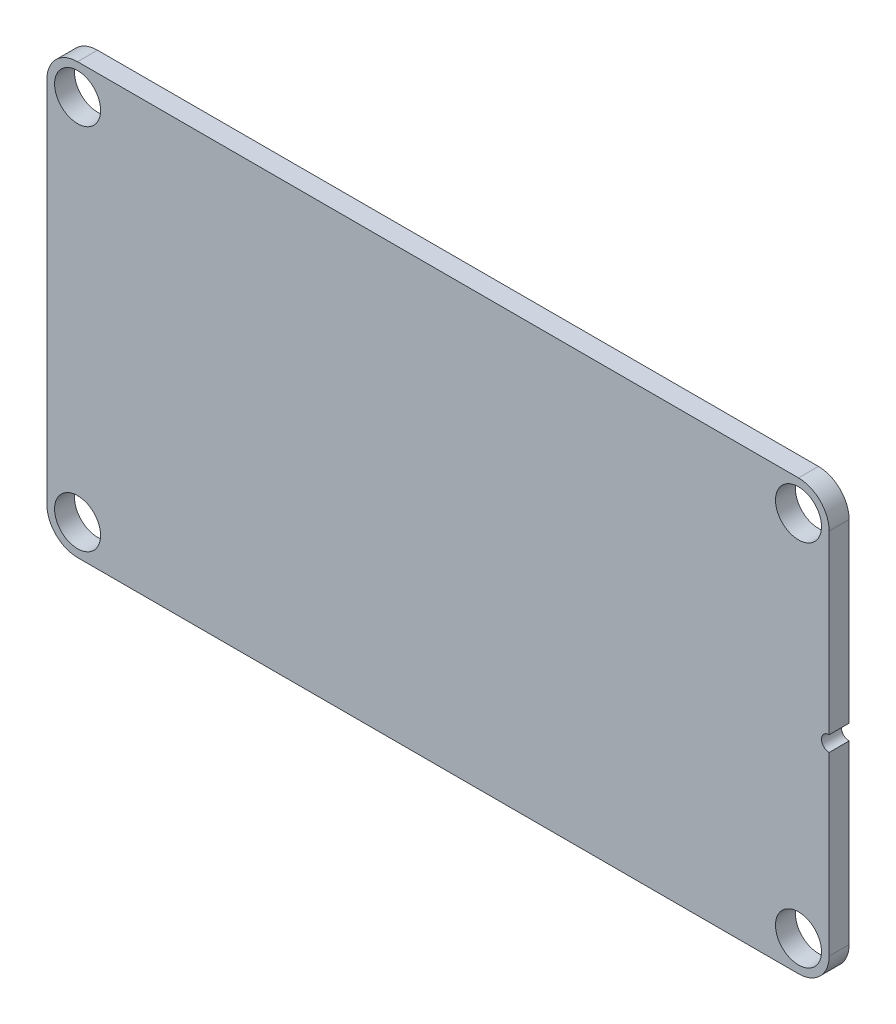
ISO-10303-21;
HEADER;
FILE_DESCRIPTION(('STEP AP214'),'2;1');
FILE_NAME('part.step','',(''),(''),'','','');
FILE_SCHEMA(('AUTOMOTIVE_DESIGN { 1 0 10303 214 1 1 1 1 }'));
ENDSEC;
DATA;
#1=APPLICATION_CONTEXT('core data for automotive mechanical design processes');
#2=APPLICATION_PROTOCOL_DEFINITION('international standard','automotive_design',2000,#1);
#3=PRODUCT_CONTEXT('',#1,'mechanical');
#4=PRODUCT('Part','Part','',(#3));
#5=PRODUCT_RELATED_PRODUCT_CATEGORY('part','',(#4));
#6=PRODUCT_DEFINITION_FORMATION('','',#4);
#7=PRODUCT_DEFINITION_CONTEXT('part definition',#1,'design');
#8=PRODUCT_DEFINITION('design','',#6,#7);
#9=PRODUCT_DEFINITION_SHAPE('','',#8);
#10=(LENGTH_UNIT() NAMED_UNIT(*) SI_UNIT(.MILLI.,.METRE.));
#11=(NAMED_UNIT(*) PLANE_ANGLE_UNIT() SI_UNIT($,.RADIAN.));
#12=(NAMED_UNIT(*) SI_UNIT($,.STERADIAN.) SOLID_ANGLE_UNIT());
#13=UNCERTAINTY_MEASURE_WITH_UNIT(LENGTH_MEASURE(1.E-05),#10,'distance_accuracy_value','');
#14=(GEOMETRIC_REPRESENTATION_CONTEXT(3) GLOBAL_UNCERTAINTY_ASSIGNED_CONTEXT((#13)) GLOBAL_UNIT_ASSIGNED_CONTEXT((#10,
#11,#12)) REPRESENTATION_CONTEXT('',''));
#15=CARTESIAN_POINT('',(0.,0.,0.));
#16=DIRECTION('',(0.,0.,1.));
#17=DIRECTION('',(1.,0.,0.));
#18=AXIS2_PLACEMENT_3D('',#15,#16,#17);
#19=CARTESIAN_POINT('',(25.5,14.,1.3));
#20=DIRECTION('',(-1.,0.,0.));
#21=DIRECTION('',(0.,0.,1.));
#22=AXIS2_PLACEMENT_3D('',#19,#20,#21);
#23=PLANE('',#22);
#24=DIRECTION('',(0.,1.,0.));
#25=VECTOR('',#24,1.);
#26=CARTESIAN_POINT('',(25.5,14.,0.));
#27=LINE('',#26,#25);
#28=CARTESIAN_POINT('',(25.5,-12.,0.));
#29=VERTEX_POINT('',#28);
#30=CARTESIAN_POINT('',(25.5,-0.499999999999997,0.));
#31=VERTEX_POINT('',#30);
#32=EDGE_CURVE('E154',#29,#31,#27,.T.);
#33=ORIENTED_EDGE('',*,*,#32,.T.);
#34=DIRECTION('',(0.,0.,1.));
#35=VECTOR('',#34,1.);
#36=CARTESIAN_POINT('',(25.5,-0.499999999999997,-7.5));
#37=LINE('',#36,#35);
#38=CARTESIAN_POINT('',(25.5,-0.499999999999997,1.3));
#39=VERTEX_POINT('',#38);
#40=EDGE_CURVE('E57',#31,#39,#37,.T.);
#41=ORIENTED_EDGE('',*,*,#40,.T.);
#42=DIRECTION('',(0.,1.,0.));
#43=VECTOR('',#42,1.);
#44=CARTESIAN_POINT('',(25.5,14.,1.3));
#45=LINE('',#44,#43);
#46=CARTESIAN_POINT('',(25.5,-12.,1.3));
#47=VERTEX_POINT('',#46);
#48=EDGE_CURVE('E133',#47,#39,#45,.T.);
#49=ORIENTED_EDGE('',*,*,#48,.F.);
#50=DIRECTION('',(0.,0.,-1.));
#51=VECTOR('',#50,1.);
#52=CARTESIAN_POINT('',(25.5,-12.,1.3));
#53=LINE('',#52,#51);
#54=EDGE_CURVE('E167',#47,#29,#53,.T.);
#55=ORIENTED_EDGE('',*,*,#54,.T.);
#56=EDGE_LOOP('',(#33,#41,#49,#55));
#57=FACE_BOUND('',#56,.T.);
#58=ADVANCED_FACE('F42',(#57),#23,.F.);
#59=CARTESIAN_POINT('',(-25.5,14.,1.3));
#60=DIRECTION('',(1.,0.,0.));
#61=DIRECTION('',(0.,1.,0.));
#62=AXIS2_PLACEMENT_3D('',#59,#60,#61);
#63=PLANE('',#62);
#64=DIRECTION('',(0.,-1.,0.));
#65=VECTOR('',#64,1.);
#66=CARTESIAN_POINT('',(-25.5,14.,1.3));
#67=LINE('',#66,#65);
#68=CARTESIAN_POINT('',(-25.5,12.,1.3));
#69=VERTEX_POINT('',#68);
#70=CARTESIAN_POINT('',(-25.5,-12.,1.3));
#71=VERTEX_POINT('',#70);
#72=EDGE_CURVE('E142',#69,#71,#67,.T.);
#73=ORIENTED_EDGE('',*,*,#72,.F.);
#74=DIRECTION('',(0.,0.,-1.));
#75=VECTOR('',#74,1.);
#76=CARTESIAN_POINT('',(-25.5,12.,1.3));
#77=LINE('',#76,#75);
#78=CARTESIAN_POINT('',(-25.5,12.,0.));
#79=VERTEX_POINT('',#78);
#80=EDGE_CURVE('E189',#69,#79,#77,.T.);
#81=ORIENTED_EDGE('',*,*,#80,.T.);
#82=DIRECTION('',(0.,-1.,0.));
#83=VECTOR('',#82,1.);
#84=CARTESIAN_POINT('',(-25.5,14.,0.));
#85=LINE('',#84,#83);
#86=CARTESIAN_POINT('',(-25.5,-12.,0.));
#87=VERTEX_POINT('',#86);
#88=EDGE_CURVE('E148',#79,#87,#85,.T.);
#89=ORIENTED_EDGE('',*,*,#88,.T.);
#90=DIRECTION('',(0.,0.,-1.));
#91=VECTOR('',#90,1.);
#92=CARTESIAN_POINT('',(-25.5,-12.,1.3));
#93=LINE('',#92,#91);
#94=EDGE_CURVE('E184',#87,#71,#93,.F.);
#95=ORIENTED_EDGE('',*,*,#94,.T.);
#96=EDGE_LOOP('',(#73,#81,#89,#95));
#97=FACE_BOUND('',#96,.T.);
#98=ADVANCED_FACE('F199',(#97),#63,.F.);
#99=CARTESIAN_POINT('',(-25.5,-14.,1.3));
#100=DIRECTION('',(0.,1.,0.));
#101=DIRECTION('',(-1.,0.,0.));
#102=AXIS2_PLACEMENT_3D('',#99,#100,#101);
#103=PLANE('',#102);
#104=DIRECTION('',(1.,0.,0.));
#105=VECTOR('',#104,1.);
#106=CARTESIAN_POINT('',(-25.5,-14.,1.3));
#107=LINE('',#106,#105);
#108=CARTESIAN_POINT('',(-23.5,-14.,1.3));
#109=VERTEX_POINT('',#108);
#110=CARTESIAN_POINT('',(23.5,-14.,1.3));
#111=VERTEX_POINT('',#110);
#112=EDGE_CURVE('E139',#109,#111,#107,.T.);
#113=ORIENTED_EDGE('',*,*,#112,.F.);
#114=DIRECTION('',(0.,0.,-1.));
#115=VECTOR('',#114,1.);
#116=CARTESIAN_POINT('',(-23.5,-14.,1.3));
#117=LINE('',#116,#115);
#118=CARTESIAN_POINT('',(-23.5,-14.,0.));
#119=VERTEX_POINT('',#118);
#120=EDGE_CURVE('E178',#109,#119,#117,.T.);
#121=ORIENTED_EDGE('',*,*,#120,.T.);
#122=DIRECTION('',(1.,0.,0.));
#123=VECTOR('',#122,1.);
#124=CARTESIAN_POINT('',(-25.5,-14.,0.));
#125=LINE('',#124,#123);
#126=CARTESIAN_POINT('',(23.5,-14.,0.));
#127=VERTEX_POINT('',#126);
#128=EDGE_CURVE('E150',#119,#127,#125,.T.);
#129=ORIENTED_EDGE('',*,*,#128,.T.);
#130=DIRECTION('',(0.,0.,-1.));
#131=VECTOR('',#130,1.);
#132=CARTESIAN_POINT('',(23.5,-14.,1.3));
#133=LINE('',#132,#131);
#134=EDGE_CURVE('E173',#127,#111,#133,.F.);
#135=ORIENTED_EDGE('',*,*,#134,.T.);
#136=EDGE_LOOP('',(#113,#121,#129,#135));
#137=FACE_BOUND('',#136,.T.);
#138=ADVANCED_FACE('F220',(#137),#103,.F.);
#139=CARTESIAN_POINT('',(25.5,0.500000000000001,1.3));
#140=VERTEX_POINT('',#139);
#141=CARTESIAN_POINT('',(25.5,12.,1.3));
#142=VERTEX_POINT('',#141);
#143=EDGE_CURVE('E130',#140,#142,#45,.T.);
#144=ORIENTED_EDGE('',*,*,#143,.F.);
#145=DIRECTION('',(0.,0.,1.));
#146=VECTOR('',#145,1.);
#147=CARTESIAN_POINT('',(25.5,0.500000000000001,-7.5));
#148=LINE('',#147,#146);
#149=CARTESIAN_POINT('',(25.5,0.500000000000001,0.));
#150=VERTEX_POINT('',#149);
#151=EDGE_CURVE('E118',#140,#150,#148,.F.);
#152=ORIENTED_EDGE('',*,*,#151,.T.);
#153=CARTESIAN_POINT('',(25.5,12.,0.));
#154=VERTEX_POINT('',#153);
#155=EDGE_CURVE('E153',#150,#154,#27,.T.);
#156=ORIENTED_EDGE('',*,*,#155,.T.);
#157=DIRECTION('',(0.,0.,-1.));
#158=VECTOR('',#157,1.);
#159=CARTESIAN_POINT('',(25.5,12.,1.3));
#160=LINE('',#159,#158);
#161=EDGE_CURVE('E137',#154,#142,#160,.F.);
#162=ORIENTED_EDGE('',*,*,#161,.T.);
#163=EDGE_LOOP('',(#144,#152,#156,#162));
#164=FACE_BOUND('',#163,.T.);
#165=ADVANCED_FACE('F135',(#164),#23,.F.);
#166=CARTESIAN_POINT('',(-25.5,14.,1.3));
#167=DIRECTION('',(0.,-1.,0.));
#168=DIRECTION('',(0.,0.,-1.));
#169=AXIS2_PLACEMENT_3D('',#166,#167,#168);
#170=PLANE('',#169);
#171=DIRECTION('',(-1.,0.,0.));
#172=VECTOR('',#171,1.);
#173=CARTESIAN_POINT('',(-25.5,14.,0.));
#174=LINE('',#173,#172);
#175=CARTESIAN_POINT('',(23.5,14.,0.));
#176=VERTEX_POINT('',#175);
#177=CARTESIAN_POINT('',(-23.5,14.,0.));
#178=VERTEX_POINT('',#177);
#179=EDGE_CURVE('E157',#176,#178,#174,.T.);
#180=ORIENTED_EDGE('',*,*,#179,.T.);
#181=DIRECTION('',(0.,0.,-1.));
#182=VECTOR('',#181,1.);
#183=CARTESIAN_POINT('',(-23.5,14.,1.3));
#184=LINE('',#183,#182);
#185=CARTESIAN_POINT('',(-23.5,14.,1.3));
#186=VERTEX_POINT('',#185);
#187=EDGE_CURVE('E64',#178,#186,#184,.F.);
#188=ORIENTED_EDGE('',*,*,#187,.T.);
#189=DIRECTION('',(-1.,0.,0.));
#190=VECTOR('',#189,1.);
#191=CARTESIAN_POINT('',(-25.5,14.,1.3));
#192=LINE('',#191,#190);
#193=CARTESIAN_POINT('',(23.5,14.,1.3));
#194=VERTEX_POINT('',#193);
#195=EDGE_CURVE('E141',#194,#186,#192,.T.);
#196=ORIENTED_EDGE('',*,*,#195,.F.);
#197=DIRECTION('',(0.,0.,-1.));
#198=VECTOR('',#197,1.);
#199=CARTESIAN_POINT('',(23.5,14.,1.3));
#200=LINE('',#199,#198);
#201=EDGE_CURVE('E147',#194,#176,#200,.T.);
#202=ORIENTED_EDGE('',*,*,#201,.T.);
#203=EDGE_LOOP('',(#180,#188,#196,#202));
#204=FACE_BOUND('',#203,.T.);
#205=ADVANCED_FACE('F206',(#204),#170,.F.);
#206=CARTESIAN_POINT('',(0.,0.,1.3));
#207=DIRECTION('',(0.,0.,1.));
#208=DIRECTION('',(1.,0.,0.));
#209=AXIS2_PLACEMENT_3D('',#206,#207,#208);
#210=PLANE('',#209);
#211=CARTESIAN_POINT('',(25.5,0.,1.3));
#212=DIRECTION('',(0.,0.,1.));
#213=DIRECTION('',(1.,0.,0.));
#214=AXIS2_PLACEMENT_3D('',#211,#212,#213);
#215=CIRCLE('',#214,0.499999999999999);
#216=EDGE_CURVE('E121',#140,#39,#215,.T.);
#217=ORIENTED_EDGE('',*,*,#216,.F.);
#218=ORIENTED_EDGE('',*,*,#143,.T.);
#219=CARTESIAN_POINT('',(23.5,12.,1.3));
#220=DIRECTION('',(0.,0.,1.));
#221=DIRECTION('',(1.,0.,0.));
#222=AXIS2_PLACEMENT_3D('',#219,#220,#221);
#223=CIRCLE('',#222,2.);
#224=EDGE_CURVE('E165',#142,#194,#223,.T.);
#225=ORIENTED_EDGE('',*,*,#224,.T.);
#226=ORIENTED_EDGE('',*,*,#195,.T.);
#227=CARTESIAN_POINT('',(-23.5,12.,1.3));
#228=DIRECTION('',(0.,0.,1.));
#229=DIRECTION('',(1.,0.,0.));
#230=AXIS2_PLACEMENT_3D('',#227,#228,#229);
#231=CIRCLE('',#230,2.);
#232=EDGE_CURVE('E50',#186,#69,#231,.T.);
#233=ORIENTED_EDGE('',*,*,#232,.T.);
#234=ORIENTED_EDGE('',*,*,#72,.T.);
#235=CARTESIAN_POINT('',(-23.5,-12.,1.3));
#236=DIRECTION('',(0.,0.,1.));
#237=DIRECTION('',(1.,0.,0.));
#238=AXIS2_PLACEMENT_3D('',#235,#236,#237);
#239=CIRCLE('',#238,2.);
#240=EDGE_CURVE('E187',#71,#109,#239,.T.);
#241=ORIENTED_EDGE('',*,*,#240,.T.);
#242=ORIENTED_EDGE('',*,*,#112,.T.);
#243=CARTESIAN_POINT('',(23.5,-12.,1.3));
#244=DIRECTION('',(0.,0.,1.));
#245=DIRECTION('',(1.,0.,0.));
#246=AXIS2_PLACEMENT_3D('',#243,#244,#245);
#247=CIRCLE('',#246,2.);
#248=EDGE_CURVE('E176',#111,#47,#247,.T.);
#249=ORIENTED_EDGE('',*,*,#248,.T.);
#250=ORIENTED_EDGE('',*,*,#48,.T.);
#251=EDGE_LOOP('',(#217,#218,#225,#226,#233,#234,#241,#242,#249,#250));
#252=FACE_BOUND('',#251,.T.);
#253=CARTESIAN_POINT('',(-23.5,12.,1.3));
#254=DIRECTION('',(0.,0.,1.));
#255=DIRECTION('',(1.,0.,0.));
#256=AXIS2_PLACEMENT_3D('',#253,#254,#255);
#257=CIRCLE('',#256,1.5);
#258=CARTESIAN_POINT('',(-22.,12.,1.3));
#259=VERTEX_POINT('',#258);
#260=EDGE_CURVE('E294',#259,#259,#257,.T.);
#261=ORIENTED_EDGE('',*,*,#260,.F.);
#262=EDGE_LOOP('',(#261));
#263=FACE_BOUND('',#262,.T.);
#264=CARTESIAN_POINT('',(-23.5,-12.,1.3));
#265=DIRECTION('',(0.,0.,1.));
#266=DIRECTION('',(1.,0.,0.));
#267=AXIS2_PLACEMENT_3D('',#264,#265,#266);
#268=CIRCLE('',#267,1.5);
#269=CARTESIAN_POINT('',(-22.,-12.,1.3));
#270=VERTEX_POINT('',#269);
#271=EDGE_CURVE('E298',#270,#270,#268,.T.);
#272=ORIENTED_EDGE('',*,*,#271,.F.);
#273=EDGE_LOOP('',(#272));
#274=FACE_BOUND('',#273,.T.);
#275=CARTESIAN_POINT('',(23.5,-12.,1.3));
#276=DIRECTION('',(0.,0.,1.));
#277=DIRECTION('',(1.,0.,0.));
#278=AXIS2_PLACEMENT_3D('',#275,#276,#277);
#279=CIRCLE('',#278,1.5);
#280=CARTESIAN_POINT('',(25.,-12.,1.3));
#281=VERTEX_POINT('',#280);
#282=EDGE_CURVE('E290',#281,#281,#279,.T.);
#283=ORIENTED_EDGE('',*,*,#282,.F.);
#284=EDGE_LOOP('',(#283));
#285=FACE_BOUND('',#284,.T.);
#286=CARTESIAN_POINT('',(23.5,12.,1.3));
#287=DIRECTION('',(0.,0.,1.));
#288=DIRECTION('',(1.,0.,0.));
#289=AXIS2_PLACEMENT_3D('',#286,#287,#288);
#290=CIRCLE('',#289,1.5);
#291=CARTESIAN_POINT('',(25.,12.,1.3));
#292=VERTEX_POINT('',#291);
#293=EDGE_CURVE('E287',#292,#292,#290,.T.);
#294=ORIENTED_EDGE('',*,*,#293,.F.);
#295=EDGE_LOOP('',(#294));
#296=FACE_BOUND('',#295,.T.);
#297=ADVANCED_FACE('F128',(#252,#263,#274,#285,#296),#210,.T.);
#298=CARTESIAN_POINT('',(0.,0.,0.));
#299=DIRECTION('',(0.,0.,1.));
#300=DIRECTION('',(1.,0.,0.));
#301=AXIS2_PLACEMENT_3D('',#298,#299,#300);
#302=PLANE('',#301);
#303=CARTESIAN_POINT('',(-23.5,12.,0.));
#304=DIRECTION('',(0.,0.,1.));
#305=DIRECTION('',(1.,0.,0.));
#306=AXIS2_PLACEMENT_3D('',#303,#304,#305);
#307=CIRCLE('',#306,1.5);
#308=CARTESIAN_POINT('',(-22.,12.,0.));
#309=VERTEX_POINT('',#308);
#310=EDGE_CURVE('E276',#309,#309,#307,.T.);
#311=ORIENTED_EDGE('',*,*,#310,.T.);
#312=EDGE_LOOP('',(#311));
#313=FACE_BOUND('',#312,.T.);
#314=CARTESIAN_POINT('',(-23.5,-12.,0.));
#315=DIRECTION('',(0.,0.,1.));
#316=DIRECTION('',(1.,0.,0.));
#317=AXIS2_PLACEMENT_3D('',#314,#315,#316);
#318=CIRCLE('',#317,1.5);
#319=CARTESIAN_POINT('',(-22.,-12.,0.));
#320=VERTEX_POINT('',#319);
#321=EDGE_CURVE('E280',#320,#320,#318,.T.);
#322=ORIENTED_EDGE('',*,*,#321,.T.);
#323=EDGE_LOOP('',(#322));
#324=FACE_BOUND('',#323,.T.);
#325=CARTESIAN_POINT('',(23.5,-12.,0.));
#326=DIRECTION('',(0.,0.,1.));
#327=DIRECTION('',(1.,0.,0.));
#328=AXIS2_PLACEMENT_3D('',#325,#326,#327);
#329=CIRCLE('',#328,1.5);
#330=CARTESIAN_POINT('',(25.,-12.,0.));
#331=VERTEX_POINT('',#330);
#332=EDGE_CURVE('E284',#331,#331,#329,.T.);
#333=ORIENTED_EDGE('',*,*,#332,.T.);
#334=EDGE_LOOP('',(#333));
#335=FACE_BOUND('',#334,.T.);
#336=CARTESIAN_POINT('',(23.5,12.,0.));
#337=DIRECTION('',(0.,0.,1.));
#338=DIRECTION('',(1.,0.,0.));
#339=AXIS2_PLACEMENT_3D('',#336,#337,#338);
#340=CIRCLE('',#339,1.5);
#341=CARTESIAN_POINT('',(25.,12.,0.));
#342=VERTEX_POINT('',#341);
#343=EDGE_CURVE('E151',#342,#342,#340,.T.);
#344=ORIENTED_EDGE('',*,*,#343,.T.);
#345=EDGE_LOOP('',(#344));
#346=FACE_BOUND('',#345,.T.);
#347=ORIENTED_EDGE('',*,*,#155,.F.);
#348=CARTESIAN_POINT('',(25.5,0.,0.));
#349=DIRECTION('',(0.,0.,1.));
#350=DIRECTION('',(1.,0.,0.));
#351=AXIS2_PLACEMENT_3D('',#348,#349,#350);
#352=CIRCLE('',#351,0.499999999999999);
#353=EDGE_CURVE('E11',#150,#31,#352,.T.);
#354=ORIENTED_EDGE('',*,*,#353,.T.);
#355=ORIENTED_EDGE('',*,*,#32,.F.);
#356=CARTESIAN_POINT('',(23.5,-12.,0.));
#357=DIRECTION('',(0.,0.,1.));
#358=DIRECTION('',(1.,0.,0.));
#359=AXIS2_PLACEMENT_3D('',#356,#357,#358);
#360=CIRCLE('',#359,2.);
#361=EDGE_CURVE('E170',#29,#127,#360,.F.);
#362=ORIENTED_EDGE('',*,*,#361,.T.);
#363=ORIENTED_EDGE('',*,*,#128,.F.);
#364=CARTESIAN_POINT('',(-23.5,-12.,0.));
#365=DIRECTION('',(0.,0.,1.));
#366=DIRECTION('',(1.,0.,0.));
#367=AXIS2_PLACEMENT_3D('',#364,#365,#366);
#368=CIRCLE('',#367,2.);
#369=EDGE_CURVE('E181',#119,#87,#368,.F.);
#370=ORIENTED_EDGE('',*,*,#369,.T.);
#371=ORIENTED_EDGE('',*,*,#88,.F.);
#372=CARTESIAN_POINT('',(-23.5,12.,0.));
#373=DIRECTION('',(0.,0.,1.));
#374=DIRECTION('',(1.,0.,0.));
#375=AXIS2_PLACEMENT_3D('',#372,#373,#374);
#376=CIRCLE('',#375,2.);
#377=EDGE_CURVE('E192',#79,#178,#376,.F.);
#378=ORIENTED_EDGE('',*,*,#377,.T.);
#379=ORIENTED_EDGE('',*,*,#179,.F.);
#380=CARTESIAN_POINT('',(23.5,12.,0.));
#381=DIRECTION('',(0.,0.,1.));
#382=DIRECTION('',(1.,0.,0.));
#383=AXIS2_PLACEMENT_3D('',#380,#381,#382);
#384=CIRCLE('',#383,2.);
#385=EDGE_CURVE('E161',#176,#154,#384,.F.);
#386=ORIENTED_EDGE('',*,*,#385,.T.);
#387=EDGE_LOOP('',(#347,#354,#355,#362,#363,#370,#371,#378,#379,#386));
#388=FACE_BOUND('',#387,.T.);
#389=ADVANCED_FACE('F205',(#313,#324,#335,#346,#388),#302,.F.);
#390=CARTESIAN_POINT('',(23.5,12.,0.));
#391=DIRECTION('',(0.,0.,1.));
#392=DIRECTION('',(1.,0.,0.));
#393=AXIS2_PLACEMENT_3D('',#390,#391,#392);
#394=CYLINDRICAL_SURFACE('',#393,1.5);
#395=ORIENTED_EDGE('',*,*,#343,.F.);
#396=EDGE_LOOP('',(#395));
#397=FACE_BOUND('',#396,.T.);
#398=ORIENTED_EDGE('',*,*,#293,.T.);
#399=EDGE_LOOP('',(#398));
#400=FACE_BOUND('',#399,.T.);
#401=ADVANCED_FACE('F264',(#397,#400),#394,.F.);
#402=CARTESIAN_POINT('',(23.5,-12.,0.));
#403=DIRECTION('',(0.,0.,1.));
#404=DIRECTION('',(1.,0.,0.));
#405=AXIS2_PLACEMENT_3D('',#402,#403,#404);
#406=CYLINDRICAL_SURFACE('',#405,1.5);
#407=ORIENTED_EDGE('',*,*,#332,.F.);
#408=EDGE_LOOP('',(#407));
#409=FACE_BOUND('',#408,.T.);
#410=ORIENTED_EDGE('',*,*,#282,.T.);
#411=EDGE_LOOP('',(#410));
#412=FACE_BOUND('',#411,.T.);
#413=ADVANCED_FACE('F257',(#409,#412),#406,.F.);
#414=CARTESIAN_POINT('',(-23.5,-12.,0.));
#415=DIRECTION('',(0.,0.,1.));
#416=DIRECTION('',(1.,0.,0.));
#417=AXIS2_PLACEMENT_3D('',#414,#415,#416);
#418=CYLINDRICAL_SURFACE('',#417,1.5);
#419=ORIENTED_EDGE('',*,*,#321,.F.);
#420=EDGE_LOOP('',(#419));
#421=FACE_BOUND('',#420,.T.);
#422=ORIENTED_EDGE('',*,*,#271,.T.);
#423=EDGE_LOOP('',(#422));
#424=FACE_BOUND('',#423,.T.);
#425=ADVANCED_FACE('F251',(#421,#424),#418,.F.);
#426=CARTESIAN_POINT('',(-23.5,12.,0.));
#427=DIRECTION('',(0.,0.,1.));
#428=DIRECTION('',(1.,0.,0.));
#429=AXIS2_PLACEMENT_3D('',#426,#427,#428);
#430=CYLINDRICAL_SURFACE('',#429,1.5);
#431=ORIENTED_EDGE('',*,*,#310,.F.);
#432=EDGE_LOOP('',(#431));
#433=FACE_BOUND('',#432,.T.);
#434=ORIENTED_EDGE('',*,*,#260,.T.);
#435=EDGE_LOOP('',(#434));
#436=FACE_BOUND('',#435,.T.);
#437=ADVANCED_FACE('F247',(#433,#436),#430,.F.);
#438=CARTESIAN_POINT('',(23.5,12.,1.3));
#439=DIRECTION('',(0.,0.,-1.));
#440=DIRECTION('',(-1.,0.,0.));
#441=AXIS2_PLACEMENT_3D('',#438,#439,#440);
#442=CYLINDRICAL_SURFACE('',#441,2.);
#443=ORIENTED_EDGE('',*,*,#224,.F.);
#444=ORIENTED_EDGE('',*,*,#161,.F.);
#445=ORIENTED_EDGE('',*,*,#385,.F.);
#446=ORIENTED_EDGE('',*,*,#201,.F.);
#447=EDGE_LOOP('',(#443,#444,#445,#446));
#448=FACE_BOUND('',#447,.T.);
#449=ADVANCED_FACE('F209',(#448),#442,.T.);
#450=CARTESIAN_POINT('',(23.5,-12.,1.3));
#451=DIRECTION('',(0.,0.,-1.));
#452=DIRECTION('',(-1.,0.,0.));
#453=AXIS2_PLACEMENT_3D('',#450,#451,#452);
#454=CYLINDRICAL_SURFACE('',#453,2.);
#455=ORIENTED_EDGE('',*,*,#248,.F.);
#456=ORIENTED_EDGE('',*,*,#134,.F.);
#457=ORIENTED_EDGE('',*,*,#361,.F.);
#458=ORIENTED_EDGE('',*,*,#54,.F.);
#459=EDGE_LOOP('',(#455,#456,#457,#458));
#460=FACE_BOUND('',#459,.T.);
#461=ADVANCED_FACE('F215',(#460),#454,.T.);
#462=CARTESIAN_POINT('',(-23.5,-12.,1.3));
#463=DIRECTION('',(0.,0.,-1.));
#464=DIRECTION('',(-1.,0.,0.));
#465=AXIS2_PLACEMENT_3D('',#462,#463,#464);
#466=CYLINDRICAL_SURFACE('',#465,2.);
#467=ORIENTED_EDGE('',*,*,#240,.F.);
#468=ORIENTED_EDGE('',*,*,#94,.F.);
#469=ORIENTED_EDGE('',*,*,#369,.F.);
#470=ORIENTED_EDGE('',*,*,#120,.F.);
#471=EDGE_LOOP('',(#467,#468,#469,#470));
#472=FACE_BOUND('',#471,.T.);
#473=ADVANCED_FACE('F223',(#472),#466,.T.);
#474=CARTESIAN_POINT('',(-23.5,12.,1.3));
#475=DIRECTION('',(0.,0.,-1.));
#476=DIRECTION('',(-1.,0.,0.));
#477=AXIS2_PLACEMENT_3D('',#474,#475,#476);
#478=CYLINDRICAL_SURFACE('',#477,2.);
#479=ORIENTED_EDGE('',*,*,#232,.F.);
#480=ORIENTED_EDGE('',*,*,#187,.F.);
#481=ORIENTED_EDGE('',*,*,#377,.F.);
#482=ORIENTED_EDGE('',*,*,#80,.F.);
#483=EDGE_LOOP('',(#479,#480,#481,#482));
#484=FACE_BOUND('',#483,.T.);
#485=ADVANCED_FACE('F44',(#484),#478,.T.);
#486=CARTESIAN_POINT('',(25.5,0.,-7.5));
#487=DIRECTION('',(0.,0.,1.));
#488=DIRECTION('',(1.,0.,0.));
#489=AXIS2_PLACEMENT_3D('',#486,#487,#488);
#490=CYLINDRICAL_SURFACE('',#489,0.499999999999999);
#491=ORIENTED_EDGE('',*,*,#353,.F.);
#492=ORIENTED_EDGE('',*,*,#151,.F.);
#493=ORIENTED_EDGE('',*,*,#216,.T.);
#494=ORIENTED_EDGE('',*,*,#40,.F.);
#495=EDGE_LOOP('',(#491,#492,#493,#494));
#496=FACE_BOUND('',#495,.T.);
#497=ADVANCED_FACE('F120',(#496),#490,.F.);
#498=CLOSED_SHELL('',(#58,#98,#138,#165,#205,#297,#389,#401,#413,#425,#437,#449,#461,#473,#485,#497));
#499=MANIFOLD_SOLID_BREP('B2',#498);
#500=ADVANCED_BREP_SHAPE_REPRESENTATION('',(#18,#499),#14);
#501=SHAPE_DEFINITION_REPRESENTATION(#9,#500);
ENDSEC;
END-ISO-10303-21;
